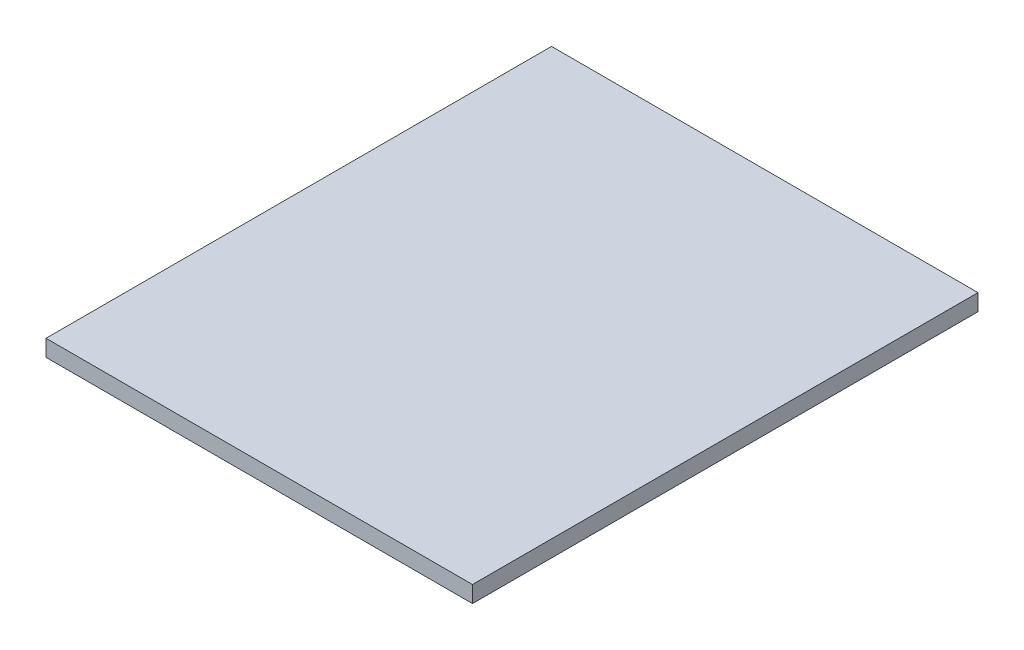
ISO-10303-21;
HEADER;
FILE_DESCRIPTION(('STEP AP214'),'2;1');
FILE_NAME('part.step','',(''),(''),'','','');
FILE_SCHEMA(('AUTOMOTIVE_DESIGN { 1 0 10303 214 1 1 1 1 }'));
ENDSEC;
DATA;
#1=APPLICATION_CONTEXT('core data for automotive mechanical design processes');
#2=APPLICATION_PROTOCOL_DEFINITION('international standard','automotive_design',2000,#1);
#3=PRODUCT_CONTEXT('',#1,'mechanical');
#4=PRODUCT('Part','Part','',(#3));
#5=PRODUCT_RELATED_PRODUCT_CATEGORY('part','',(#4));
#6=PRODUCT_DEFINITION_FORMATION('','',#4);
#7=PRODUCT_DEFINITION_CONTEXT('part definition',#1,'design');
#8=PRODUCT_DEFINITION('design','',#6,#7);
#9=PRODUCT_DEFINITION_SHAPE('','',#8);
#10=(LENGTH_UNIT() NAMED_UNIT(*) SI_UNIT(.MILLI.,.METRE.));
#11=(NAMED_UNIT(*) PLANE_ANGLE_UNIT() SI_UNIT($,.RADIAN.));
#12=(NAMED_UNIT(*) SI_UNIT($,.STERADIAN.) SOLID_ANGLE_UNIT());
#13=UNCERTAINTY_MEASURE_WITH_UNIT(LENGTH_MEASURE(1.E-05),#10,'distance_accuracy_value','');
#14=(GEOMETRIC_REPRESENTATION_CONTEXT(3) GLOBAL_UNCERTAINTY_ASSIGNED_CONTEXT((#13)) GLOBAL_UNIT_ASSIGNED_CONTEXT((#10,
#11,#12)) REPRESENTATION_CONTEXT('',''));
#15=CARTESIAN_POINT('',(0.,0.,0.));
#16=DIRECTION('',(0.,0.,1.));
#17=DIRECTION('',(1.,0.,0.));
#18=AXIS2_PLACEMENT_3D('',#15,#16,#17);
#19=CARTESIAN_POINT('',(-232.,18.,275.));
#20=DIRECTION('',(1.,0.,0.));
#21=DIRECTION('',(0.,0.,-1.));
#22=AXIS2_PLACEMENT_3D('',#19,#20,#21);
#23=PLANE('',#22);
#24=DIRECTION('',(0.,0.,1.));
#25=VECTOR('',#24,1.);
#26=CARTESIAN_POINT('',(-232.,0.,275.));
#27=LINE('',#26,#25);
#28=CARTESIAN_POINT('',(-232.,0.,-275.));
#29=VERTEX_POINT('',#28);
#30=CARTESIAN_POINT('',(-232.,0.,275.));
#31=VERTEX_POINT('',#30);
#32=EDGE_CURVE('E98',#29,#31,#27,.T.);
#33=ORIENTED_EDGE('',*,*,#32,.T.);
#34=DIRECTION('',(0.,-1.,0.));
#35=VECTOR('',#34,1.);
#36=CARTESIAN_POINT('',(-232.,18.,275.));
#37=LINE('',#36,#35);
#38=CARTESIAN_POINT('',(-232.,18.,275.));
#39=VERTEX_POINT('',#38);
#40=EDGE_CURVE('E11',#39,#31,#37,.T.);
#41=ORIENTED_EDGE('',*,*,#40,.F.);
#42=DIRECTION('',(0.,0.,1.));
#43=VECTOR('',#42,1.);
#44=CARTESIAN_POINT('',(-232.,18.,275.));
#45=LINE('',#44,#43);
#46=CARTESIAN_POINT('',(-232.,18.,-275.));
#47=VERTEX_POINT('',#46);
#48=EDGE_CURVE('E86',#47,#39,#45,.T.);
#49=ORIENTED_EDGE('',*,*,#48,.F.);
#50=DIRECTION('',(0.,-1.,0.));
#51=VECTOR('',#50,1.);
#52=CARTESIAN_POINT('',(-232.,18.,-275.));
#53=LINE('',#52,#51);
#54=EDGE_CURVE('E94',#47,#29,#53,.T.);
#55=ORIENTED_EDGE('',*,*,#54,.T.);
#56=EDGE_LOOP('',(#33,#41,#49,#55));
#57=FACE_BOUND('',#56,.T.);
#58=ADVANCED_FACE('F35',(#57),#23,.F.);
#59=CARTESIAN_POINT('',(232.,18.,275.));
#60=DIRECTION('',(0.,0.,-1.));
#61=DIRECTION('',(-1.,0.,0.));
#62=AXIS2_PLACEMENT_3D('',#59,#60,#61);
#63=PLANE('',#62);
#64=DIRECTION('',(1.,0.,0.));
#65=VECTOR('',#64,1.);
#66=CARTESIAN_POINT('',(232.,0.,275.));
#67=LINE('',#66,#65);
#68=CARTESIAN_POINT('',(232.,0.,275.));
#69=VERTEX_POINT('',#68);
#70=EDGE_CURVE('E90',#31,#69,#67,.T.);
#71=ORIENTED_EDGE('',*,*,#70,.T.);
#72=DIRECTION('',(0.,-1.,0.));
#73=VECTOR('',#72,1.);
#74=CARTESIAN_POINT('',(232.,18.,275.));
#75=LINE('',#74,#73);
#76=CARTESIAN_POINT('',(232.,18.,275.));
#77=VERTEX_POINT('',#76);
#78=EDGE_CURVE('E43',#77,#69,#75,.T.);
#79=ORIENTED_EDGE('',*,*,#78,.F.);
#80=DIRECTION('',(1.,0.,0.));
#81=VECTOR('',#80,1.);
#82=CARTESIAN_POINT('',(232.,18.,275.));
#83=LINE('',#82,#81);
#84=EDGE_CURVE('E81',#39,#77,#83,.T.);
#85=ORIENTED_EDGE('',*,*,#84,.F.);
#86=ORIENTED_EDGE('',*,*,#40,.T.);
#87=EDGE_LOOP('',(#71,#79,#85,#86));
#88=FACE_BOUND('',#87,.T.);
#89=ADVANCED_FACE('F89',(#88),#63,.F.);
#90=CARTESIAN_POINT('',(232.,18.,275.));
#91=DIRECTION('',(-1.,0.,0.));
#92=DIRECTION('',(0.,0.,1.));
#93=AXIS2_PLACEMENT_3D('',#90,#91,#92);
#94=PLANE('',#93);
#95=DIRECTION('',(0.,0.,-1.));
#96=VECTOR('',#95,1.);
#97=CARTESIAN_POINT('',(232.,0.,275.));
#98=LINE('',#97,#96);
#99=CARTESIAN_POINT('',(232.,0.,-275.));
#100=VERTEX_POINT('',#99);
#101=EDGE_CURVE('E68',#69,#100,#98,.T.);
#102=ORIENTED_EDGE('',*,*,#101,.T.);
#103=DIRECTION('',(0.,-1.,0.));
#104=VECTOR('',#103,1.);
#105=CARTESIAN_POINT('',(232.,18.,-275.));
#106=LINE('',#105,#104);
#107=CARTESIAN_POINT('',(232.,18.,-275.));
#108=VERTEX_POINT('',#107);
#109=EDGE_CURVE('E91',#108,#100,#106,.T.);
#110=ORIENTED_EDGE('',*,*,#109,.F.);
#111=DIRECTION('',(0.,0.,-1.));
#112=VECTOR('',#111,1.);
#113=CARTESIAN_POINT('',(232.,18.,275.));
#114=LINE('',#113,#112);
#115=EDGE_CURVE('E84',#77,#108,#114,.T.);
#116=ORIENTED_EDGE('',*,*,#115,.F.);
#117=ORIENTED_EDGE('',*,*,#78,.T.);
#118=EDGE_LOOP('',(#102,#110,#116,#117));
#119=FACE_BOUND('',#118,.T.);
#120=ADVANCED_FACE('F92',(#119),#94,.F.);
#121=CARTESIAN_POINT('',(232.,18.,-275.));
#122=DIRECTION('',(0.,0.,1.));
#123=DIRECTION('',(1.,0.,0.));
#124=AXIS2_PLACEMENT_3D('',#121,#122,#123);
#125=PLANE('',#124);
#126=DIRECTION('',(-1.,0.,0.));
#127=VECTOR('',#126,1.);
#128=CARTESIAN_POINT('',(232.,0.,-275.));
#129=LINE('',#128,#127);
#130=EDGE_CURVE('E74',#100,#29,#129,.T.);
#131=ORIENTED_EDGE('',*,*,#130,.T.);
#132=ORIENTED_EDGE('',*,*,#54,.F.);
#133=DIRECTION('',(-1.,0.,0.));
#134=VECTOR('',#133,1.);
#135=CARTESIAN_POINT('',(232.,18.,-275.));
#136=LINE('',#135,#134);
#137=EDGE_CURVE('E51',#108,#47,#136,.T.);
#138=ORIENTED_EDGE('',*,*,#137,.F.);
#139=ORIENTED_EDGE('',*,*,#109,.T.);
#140=EDGE_LOOP('',(#131,#132,#138,#139));
#141=FACE_BOUND('',#140,.T.);
#142=ADVANCED_FACE('F105',(#141),#125,.F.);
#143=CARTESIAN_POINT('',(0.,18.,0.));
#144=DIRECTION('',(0.,1.,0.));
#145=DIRECTION('',(0.,0.,1.));
#146=AXIS2_PLACEMENT_3D('',#143,#144,#145);
#147=PLANE('',#146);
#148=ORIENTED_EDGE('',*,*,#48,.T.);
#149=ORIENTED_EDGE('',*,*,#84,.T.);
#150=ORIENTED_EDGE('',*,*,#115,.T.);
#151=ORIENTED_EDGE('',*,*,#137,.T.);
#152=EDGE_LOOP('',(#148,#149,#150,#151));
#153=FACE_BOUND('',#152,.T.);
#154=ADVANCED_FACE('F82',(#153),#147,.T.);
#155=CARTESIAN_POINT('',(0.,0.,0.));
#156=DIRECTION('',(0.,1.,0.));
#157=DIRECTION('',(0.,0.,1.));
#158=AXIS2_PLACEMENT_3D('',#155,#156,#157);
#159=PLANE('',#158);
#160=ORIENTED_EDGE('',*,*,#32,.F.);
#161=ORIENTED_EDGE('',*,*,#130,.F.);
#162=ORIENTED_EDGE('',*,*,#101,.F.);
#163=ORIENTED_EDGE('',*,*,#70,.F.);
#164=EDGE_LOOP('',(#160,#161,#162,#163));
#165=FACE_BOUND('',#164,.T.);
#166=ADVANCED_FACE('F108',(#165),#159,.F.);
#167=CLOSED_SHELL('',(#58,#89,#120,#142,#154,#166));
#168=MANIFOLD_SOLID_BREP('B2',#167);
#169=ADVANCED_BREP_SHAPE_REPRESENTATION('',(#18,#168),#14);
#170=SHAPE_DEFINITION_REPRESENTATION(#9,#169);
ENDSEC;
END-ISO-10303-21;
